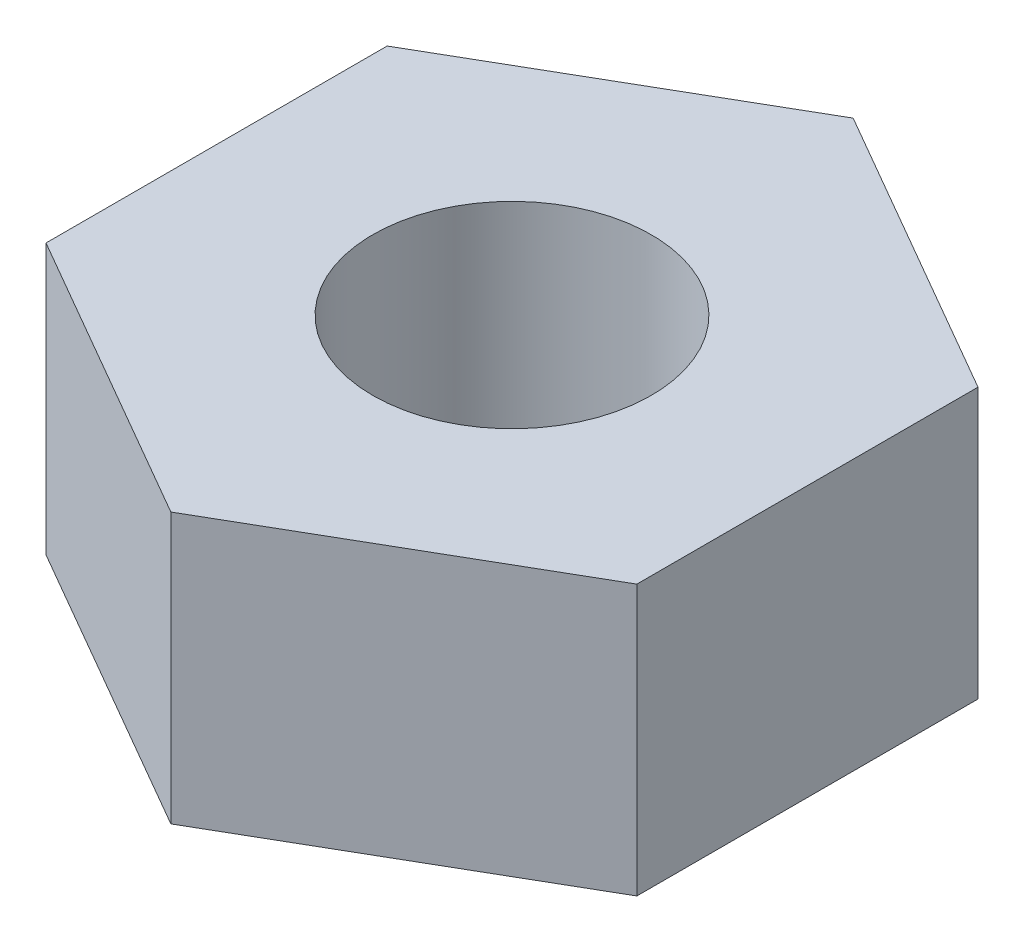
ISO-10303-21;
HEADER;
FILE_DESCRIPTION(('STEP AP214'),'2;1');
FILE_NAME('part.step','',(''),(''),'','','');
FILE_SCHEMA(('AUTOMOTIVE_DESIGN { 1 0 10303 214 1 1 1 1 }'));
ENDSEC;
DATA;
#1=APPLICATION_CONTEXT('core data for automotive mechanical design processes');
#2=APPLICATION_PROTOCOL_DEFINITION('international standard','automotive_design',2000,#1);
#3=PRODUCT_CONTEXT('',#1,'mechanical');
#4=PRODUCT('Part','Part','',(#3));
#5=PRODUCT_RELATED_PRODUCT_CATEGORY('part','',(#4));
#6=PRODUCT_DEFINITION_FORMATION('','',#4);
#7=PRODUCT_DEFINITION_CONTEXT('part definition',#1,'design');
#8=PRODUCT_DEFINITION('design','',#6,#7);
#9=PRODUCT_DEFINITION_SHAPE('','',#8);
#10=(LENGTH_UNIT() NAMED_UNIT(*) SI_UNIT(.MILLI.,.METRE.));
#11=(NAMED_UNIT(*) PLANE_ANGLE_UNIT() SI_UNIT($,.RADIAN.));
#12=(NAMED_UNIT(*) SI_UNIT($,.STERADIAN.) SOLID_ANGLE_UNIT());
#13=UNCERTAINTY_MEASURE_WITH_UNIT(LENGTH_MEASURE(1.E-05),#10,'distance_accuracy_value','');
#14=(GEOMETRIC_REPRESENTATION_CONTEXT(3) GLOBAL_UNCERTAINTY_ASSIGNED_CONTEXT((#13)) GLOBAL_UNIT_ASSIGNED_CONTEXT((#10,
#11,#12)) REPRESENTATION_CONTEXT('',''));
#15=CARTESIAN_POINT('',(0.,0.,0.));
#16=DIRECTION('',(0.,0.,1.));
#17=DIRECTION('',(1.,0.,0.));
#18=AXIS2_PLACEMENT_3D('',#15,#16,#17);
#19=CARTESIAN_POINT('',(3.49999999999998,3.2,-2.02072594216373));
#20=DIRECTION('',(-0.499999999999995,0.,0.866025403784442));
#21=DIRECTION('',(0.866025403784442,0.,0.499999999999995));
#22=AXIS2_PLACEMENT_3D('',#19,#20,#21);
#23=PLANE('',#22);
#24=DIRECTION('',(-0.866025403784442,0.,-0.499999999999995));
#25=VECTOR('',#24,1.);
#26=CARTESIAN_POINT('',(3.49999999999998,0.,-2.02072594216373));
#27=LINE('',#26,#25);
#28=CARTESIAN_POINT('',(3.49999999999998,0.,-2.02072594216373));
#29=VERTEX_POINT('',#28);
#30=CARTESIAN_POINT('',(0.,0.,-4.04145188432738));
#31=VERTEX_POINT('',#30);
#32=EDGE_CURVE('E120',#29,#31,#27,.T.);
#33=ORIENTED_EDGE('',*,*,#32,.T.);
#34=DIRECTION('',(0.,-1.,0.));
#35=VECTOR('',#34,1.);
#36=CARTESIAN_POINT('',(0.,3.2,-4.04145188432738));
#37=LINE('',#36,#35);
#38=CARTESIAN_POINT('',(0.,3.2,-4.04145188432738));
#39=VERTEX_POINT('',#38);
#40=EDGE_CURVE('E11',#39,#31,#37,.T.);
#41=ORIENTED_EDGE('',*,*,#40,.F.);
#42=DIRECTION('',(-0.866025403784442,0.,-0.499999999999995));
#43=VECTOR('',#42,1.);
#44=CARTESIAN_POINT('',(3.49999999999998,3.2,-2.02072594216373));
#45=LINE('',#44,#43);
#46=CARTESIAN_POINT('',(3.49999999999998,3.2,-2.02072594216373));
#47=VERTEX_POINT('',#46);
#48=EDGE_CURVE('E131',#47,#39,#45,.T.);
#49=ORIENTED_EDGE('',*,*,#48,.F.);
#50=DIRECTION('',(0.,-1.,0.));
#51=VECTOR('',#50,1.);
#52=CARTESIAN_POINT('',(3.49999999999998,3.2,-2.02072594216373));
#53=LINE('',#52,#51);
#54=EDGE_CURVE('E116',#47,#29,#53,.T.);
#55=ORIENTED_EDGE('',*,*,#54,.T.);
#56=EDGE_LOOP('',(#33,#41,#49,#55));
#57=FACE_BOUND('',#56,.T.);
#58=ADVANCED_FACE('F36',(#57),#23,.F.);
#59=CARTESIAN_POINT('',(0.,3.2,-4.04145188432738));
#60=DIRECTION('',(0.500000000000001,0.,0.866025403784438));
#61=DIRECTION('',(0.866025403784438,0.,-0.500000000000001));
#62=AXIS2_PLACEMENT_3D('',#59,#60,#61);
#63=PLANE('',#62);
#64=DIRECTION('',(-0.866025403784438,0.,0.500000000000001));
#65=VECTOR('',#64,1.);
#66=CARTESIAN_POINT('',(0.,0.,-4.04145188432738));
#67=LINE('',#66,#65);
#68=CARTESIAN_POINT('',(-3.50000000000001,0.,-2.02072594216368));
#69=VERTEX_POINT('',#68);
#70=EDGE_CURVE('E123',#31,#69,#67,.T.);
#71=ORIENTED_EDGE('',*,*,#70,.T.);
#72=DIRECTION('',(0.,-1.,0.));
#73=VECTOR('',#72,1.);
#74=CARTESIAN_POINT('',(-3.50000000000001,3.2,-2.02072594216368));
#75=LINE('',#74,#73);
#76=CARTESIAN_POINT('',(-3.50000000000001,3.2,-2.02072594216368));
#77=VERTEX_POINT('',#76);
#78=EDGE_CURVE('E44',#77,#69,#75,.T.);
#79=ORIENTED_EDGE('',*,*,#78,.F.);
#80=DIRECTION('',(-0.866025403784438,0.,0.500000000000001));
#81=VECTOR('',#80,1.);
#82=CARTESIAN_POINT('',(0.,3.2,-4.04145188432738));
#83=LINE('',#82,#81);
#84=EDGE_CURVE('E89',#39,#77,#83,.T.);
#85=ORIENTED_EDGE('',*,*,#84,.F.);
#86=ORIENTED_EDGE('',*,*,#40,.T.);
#87=EDGE_LOOP('',(#71,#79,#85,#86));
#88=FACE_BOUND('',#87,.T.);
#89=ADVANCED_FACE('F156',(#88),#63,.F.);
#90=CARTESIAN_POINT('',(-3.50000000000001,3.2,-2.02072594216368));
#91=DIRECTION('',(1.,0.,0.));
#92=DIRECTION('',(0.,0.,-1.));
#93=AXIS2_PLACEMENT_3D('',#90,#91,#92);
#94=PLANE('',#93);
#95=DIRECTION('',(0.,0.,1.));
#96=VECTOR('',#95,1.);
#97=CARTESIAN_POINT('',(-3.50000000000001,0.,-2.02072594216368));
#98=LINE('',#97,#96);
#99=CARTESIAN_POINT('',(-3.49999999999999,0.,2.02072594216371));
#100=VERTEX_POINT('',#99);
#101=EDGE_CURVE('E126',#69,#100,#98,.T.);
#102=ORIENTED_EDGE('',*,*,#101,.T.);
#103=DIRECTION('',(0.,-1.,0.));
#104=VECTOR('',#103,1.);
#105=CARTESIAN_POINT('',(-3.49999999999999,3.2,2.02072594216371));
#106=LINE('',#105,#104);
#107=CARTESIAN_POINT('',(-3.49999999999999,3.2,2.02072594216371));
#108=VERTEX_POINT('',#107);
#109=EDGE_CURVE('E111',#108,#100,#106,.T.);
#110=ORIENTED_EDGE('',*,*,#109,.F.);
#111=DIRECTION('',(0.,0.,1.));
#112=VECTOR('',#111,1.);
#113=CARTESIAN_POINT('',(-3.50000000000001,3.2,-2.02072594216368));
#114=LINE('',#113,#112);
#115=EDGE_CURVE('E102',#77,#108,#114,.T.);
#116=ORIENTED_EDGE('',*,*,#115,.F.);
#117=ORIENTED_EDGE('',*,*,#78,.T.);
#118=EDGE_LOOP('',(#102,#110,#116,#117));
#119=FACE_BOUND('',#118,.T.);
#120=ADVANCED_FACE('F137',(#119),#94,.F.);
#121=CARTESIAN_POINT('',(-3.49999999999999,3.2,2.02072594216371));
#122=DIRECTION('',(0.499999999999995,0.,-0.866025403784441));
#123=DIRECTION('',(-0.866025403784442,0.,-0.499999999999995));
#124=AXIS2_PLACEMENT_3D('',#121,#122,#123);
#125=PLANE('',#124);
#126=DIRECTION('',(0.866025403784441,0.,0.499999999999995));
#127=VECTOR('',#126,1.);
#128=CARTESIAN_POINT('',(-3.49999999999999,0.,2.02072594216371));
#129=LINE('',#128,#127);
#130=CARTESIAN_POINT('',(0.,0.,4.04145188432738));
#131=VERTEX_POINT('',#130);
#132=EDGE_CURVE('E110',#100,#131,#129,.T.);
#133=ORIENTED_EDGE('',*,*,#132,.T.);
#134=DIRECTION('',(0.,-1.,0.));
#135=VECTOR('',#134,1.);
#136=CARTESIAN_POINT('',(0.,3.2,4.04145188432738));
#137=LINE('',#136,#135);
#138=CARTESIAN_POINT('',(0.,3.2,4.04145188432738));
#139=VERTEX_POINT('',#138);
#140=EDGE_CURVE('E107',#139,#131,#137,.T.);
#141=ORIENTED_EDGE('',*,*,#140,.F.);
#142=DIRECTION('',(0.866025403784441,0.,0.499999999999995));
#143=VECTOR('',#142,1.);
#144=CARTESIAN_POINT('',(-3.49999999999999,3.2,2.02072594216371));
#145=LINE('',#144,#143);
#146=EDGE_CURVE('E96',#108,#139,#145,.T.);
#147=ORIENTED_EDGE('',*,*,#146,.F.);
#148=ORIENTED_EDGE('',*,*,#109,.T.);
#149=EDGE_LOOP('',(#133,#141,#147,#148));
#150=FACE_BOUND('',#149,.T.);
#151=ADVANCED_FACE('F108',(#150),#125,.F.);
#152=CARTESIAN_POINT('',(0.,3.2,4.04145188432738));
#153=DIRECTION('',(-0.500000000000007,0.,-0.866025403784435));
#154=DIRECTION('',(-0.866025403784435,0.,0.500000000000007));
#155=AXIS2_PLACEMENT_3D('',#152,#153,#154);
#156=PLANE('',#155);
#157=DIRECTION('',(0.866025403784435,0.,-0.500000000000007));
#158=VECTOR('',#157,1.);
#159=CARTESIAN_POINT('',(0.,0.,4.04145188432738));
#160=LINE('',#159,#158);
#161=CARTESIAN_POINT('',(3.50000000000002,0.,2.02072594216366));
#162=VERTEX_POINT('',#161);
#163=EDGE_CURVE('E75',#131,#162,#160,.T.);
#164=ORIENTED_EDGE('',*,*,#163,.T.);
#165=DIRECTION('',(0.,-1.,0.));
#166=VECTOR('',#165,1.);
#167=CARTESIAN_POINT('',(3.50000000000002,3.2,2.02072594216366));
#168=LINE('',#167,#166);
#169=CARTESIAN_POINT('',(3.50000000000002,3.2,2.02072594216366));
#170=VERTEX_POINT('',#169);
#171=EDGE_CURVE('E112',#170,#162,#168,.T.);
#172=ORIENTED_EDGE('',*,*,#171,.F.);
#173=DIRECTION('',(0.866025403784435,0.,-0.500000000000007));
#174=VECTOR('',#173,1.);
#175=CARTESIAN_POINT('',(0.,3.2,4.04145188432738));
#176=LINE('',#175,#174);
#177=EDGE_CURVE('E100',#139,#170,#176,.T.);
#178=ORIENTED_EDGE('',*,*,#177,.F.);
#179=ORIENTED_EDGE('',*,*,#140,.T.);
#180=EDGE_LOOP('',(#164,#172,#178,#179));
#181=FACE_BOUND('',#180,.T.);
#182=ADVANCED_FACE('F114',(#181),#156,.F.);
#183=CARTESIAN_POINT('',(3.50000000000002,3.2,2.02072594216366));
#184=DIRECTION('',(-1.,0.,0.));
#185=DIRECTION('',(0.,0.,1.));
#186=AXIS2_PLACEMENT_3D('',#183,#184,#185);
#187=PLANE('',#186);
#188=DIRECTION('',(0.,0.,-1.));
#189=VECTOR('',#188,1.);
#190=CARTESIAN_POINT('',(3.50000000000002,0.,2.02072594216366));
#191=LINE('',#190,#189);
#192=EDGE_CURVE('E81',#162,#29,#191,.T.);
#193=ORIENTED_EDGE('',*,*,#192,.T.);
#194=ORIENTED_EDGE('',*,*,#54,.F.);
#195=DIRECTION('',(0.,0.,-1.));
#196=VECTOR('',#195,1.);
#197=CARTESIAN_POINT('',(3.50000000000002,3.2,2.02072594216366));
#198=LINE('',#197,#196);
#199=EDGE_CURVE('E52',#170,#47,#198,.T.);
#200=ORIENTED_EDGE('',*,*,#199,.F.);
#201=ORIENTED_EDGE('',*,*,#171,.T.);
#202=EDGE_LOOP('',(#193,#194,#200,#201));
#203=FACE_BOUND('',#202,.T.);
#204=ADVANCED_FACE('F144',(#203),#187,.F.);
#205=CARTESIAN_POINT('',(0.,3.2,0.));
#206=DIRECTION('',(0.,1.,0.));
#207=DIRECTION('',(0.,0.,1.));
#208=AXIS2_PLACEMENT_3D('',#205,#206,#207);
#209=PLANE('',#208);
#210=CARTESIAN_POINT('',(0.,3.2,0.));
#211=DIRECTION('',(0.,1.,0.));
#212=DIRECTION('',(0.,0.,1.));
#213=AXIS2_PLACEMENT_3D('',#210,#211,#212);
#214=CIRCLE('',#213,1.65);
#215=CARTESIAN_POINT('',(0.,3.2,1.65));
#216=VERTEX_POINT('',#215);
#217=EDGE_CURVE('E211',#216,#216,#214,.T.);
#218=ORIENTED_EDGE('',*,*,#217,.F.);
#219=EDGE_LOOP('',(#218));
#220=FACE_BOUND('',#219,.T.);
#221=ORIENTED_EDGE('',*,*,#48,.T.);
#222=ORIENTED_EDGE('',*,*,#84,.T.);
#223=ORIENTED_EDGE('',*,*,#115,.T.);
#224=ORIENTED_EDGE('',*,*,#146,.T.);
#225=ORIENTED_EDGE('',*,*,#177,.T.);
#226=ORIENTED_EDGE('',*,*,#199,.T.);
#227=EDGE_LOOP('',(#221,#222,#223,#224,#225,#226));
#228=FACE_BOUND('',#227,.T.);
#229=ADVANCED_FACE('F98',(#220,#228),#209,.T.);
#230=CARTESIAN_POINT('',(0.,0.,0.));
#231=DIRECTION('',(0.,1.,0.));
#232=DIRECTION('',(0.,0.,1.));
#233=AXIS2_PLACEMENT_3D('',#230,#231,#232);
#234=PLANE('',#233);
#235=CARTESIAN_POINT('',(0.,0.,0.));
#236=DIRECTION('',(0.,1.,0.));
#237=DIRECTION('',(0.,0.,1.));
#238=AXIS2_PLACEMENT_3D('',#235,#236,#237);
#239=CIRCLE('',#238,1.65);
#240=CARTESIAN_POINT('',(0.,0.,1.65));
#241=VERTEX_POINT('',#240);
#242=EDGE_CURVE('E124',#241,#241,#239,.T.);
#243=ORIENTED_EDGE('',*,*,#242,.T.);
#244=EDGE_LOOP('',(#243));
#245=FACE_BOUND('',#244,.T.);
#246=ORIENTED_EDGE('',*,*,#32,.F.);
#247=ORIENTED_EDGE('',*,*,#192,.F.);
#248=ORIENTED_EDGE('',*,*,#163,.F.);
#249=ORIENTED_EDGE('',*,*,#132,.F.);
#250=ORIENTED_EDGE('',*,*,#101,.F.);
#251=ORIENTED_EDGE('',*,*,#70,.F.);
#252=EDGE_LOOP('',(#246,#247,#248,#249,#250,#251));
#253=FACE_BOUND('',#252,.T.);
#254=ADVANCED_FACE('F140',(#245,#253),#234,.F.);
#255=CARTESIAN_POINT('',(0.,3.2,0.));
#256=DIRECTION('',(0.,1.,0.));
#257=DIRECTION('',(0.,0.,1.));
#258=AXIS2_PLACEMENT_3D('',#255,#256,#257);
#259=CYLINDRICAL_SURFACE('',#258,1.65);
#260=ORIENTED_EDGE('',*,*,#217,.T.);
#261=EDGE_LOOP('',(#260));
#262=FACE_BOUND('',#261,.T.);
#263=ORIENTED_EDGE('',*,*,#242,.F.);
#264=EDGE_LOOP('',(#263));
#265=FACE_BOUND('',#264,.T.);
#266=ADVANCED_FACE('F193',(#262,#265),#259,.F.);
#267=CLOSED_SHELL('',(#58,#89,#120,#151,#182,#204,#229,#254,#266));
#268=MANIFOLD_SOLID_BREP('B2',#267);
#269=ADVANCED_BREP_SHAPE_REPRESENTATION('',(#18,#268),#14);
#270=SHAPE_DEFINITION_REPRESENTATION(#9,#269);
ENDSEC;
END-ISO-10303-21;
